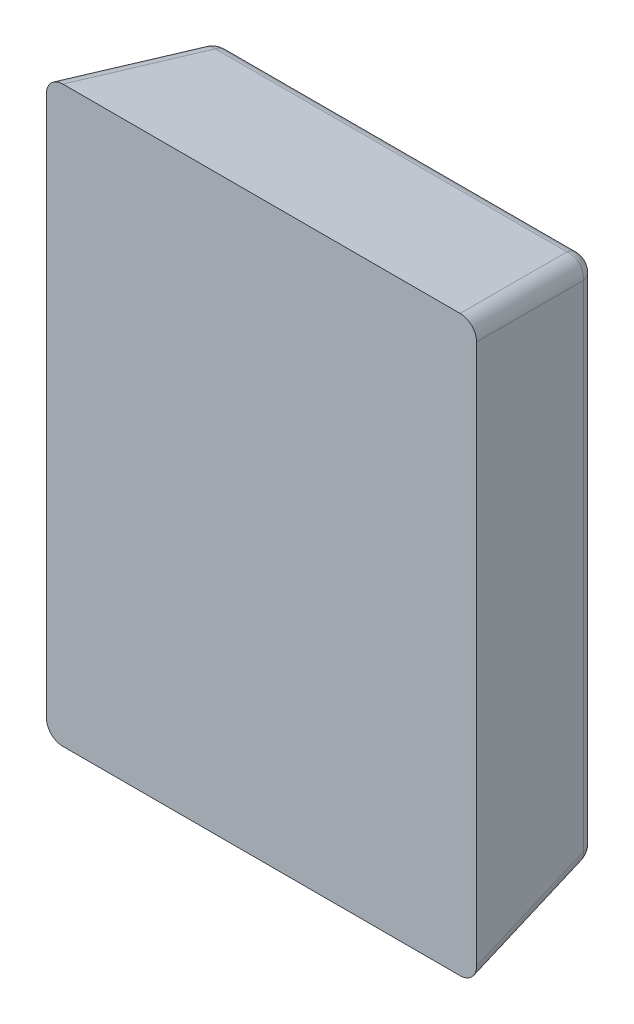
ISO-10303-21;
HEADER;
FILE_DESCRIPTION(('STEP AP214'),'2;1');
FILE_NAME('part.step','',(''),(''),'','','');
FILE_SCHEMA(('AUTOMOTIVE_DESIGN { 1 0 10303 214 1 1 1 1 }'));
ENDSEC;
DATA;
#1=APPLICATION_CONTEXT('core data for automotive mechanical design processes');
#2=APPLICATION_PROTOCOL_DEFINITION('international standard','automotive_design',2000,#1);
#3=PRODUCT_CONTEXT('',#1,'mechanical');
#4=PRODUCT('Part','Part','',(#3));
#5=PRODUCT_RELATED_PRODUCT_CATEGORY('part','',(#4));
#6=PRODUCT_DEFINITION_FORMATION('','',#4);
#7=PRODUCT_DEFINITION_CONTEXT('part definition',#1,'design');
#8=PRODUCT_DEFINITION('design','',#6,#7);
#9=PRODUCT_DEFINITION_SHAPE('','',#8);
#10=(LENGTH_UNIT() NAMED_UNIT(*) SI_UNIT(.MILLI.,.METRE.));
#11=(NAMED_UNIT(*) PLANE_ANGLE_UNIT() SI_UNIT($,.RADIAN.));
#12=(NAMED_UNIT(*) SI_UNIT($,.STERADIAN.) SOLID_ANGLE_UNIT());
#13=UNCERTAINTY_MEASURE_WITH_UNIT(LENGTH_MEASURE(1.E-05),#10,'distance_accuracy_value','');
#14=(GEOMETRIC_REPRESENTATION_CONTEXT(3) GLOBAL_UNCERTAINTY_ASSIGNED_CONTEXT((#13)) GLOBAL_UNIT_ASSIGNED_CONTEXT((#10,
#11,#12)) REPRESENTATION_CONTEXT('',''));
#15=CARTESIAN_POINT('',(0.,0.,0.));
#16=DIRECTION('',(0.,0.,1.));
#17=DIRECTION('',(1.,0.,0.));
#18=AXIS2_PLACEMENT_3D('',#15,#16,#17);
#19=CARTESIAN_POINT('',(-0.205464285309384,-0.641019643054923,0.105));
#20=DIRECTION('',(0.,0.,-1.));
#21=DIRECTION('',(-1.,0.,0.));
#22=AXIS2_PLACEMENT_3D('',#19,#20,#21);
#23=PLANE('',#22);
#24=DIRECTION('',(0.,-1.,0.));
#25=VECTOR('',#24,1.);
#26=CARTESIAN_POINT('',(-0.131917601570132,-0.701017157850477,0.105));
#27=LINE('',#26,#25);
#28=CARTESIAN_POINT('',(-0.131917601570131,-0.744561356385283,0.105));
#29=VERTEX_POINT('',#28);
#30=CARTESIAN_POINT('',(-0.131917601570132,-0.537477929724562,0.105));
#31=VERTEX_POINT('',#30);
#32=EDGE_CURVE('E134',#29,#31,#27,.F.);
#33=ORIENTED_EDGE('',*,*,#32,.F.);
#34=DIRECTION('',(-1.,0.,0.));
#35=VECTOR('',#34,1.);
#36=CARTESIAN_POINT('',(-0.250464285309384,-0.744561356385283,0.105));
#37=LINE('',#36,#35);
#38=CARTESIAN_POINT('',(-0.279010969048635,-0.744561356385283,0.105));
#39=VERTEX_POINT('',#38);
#40=EDGE_CURVE('E237',#39,#29,#37,.F.);
#41=ORIENTED_EDGE('',*,*,#40,.F.);
#42=DIRECTION('',(0.,1.,0.));
#43=VECTOR('',#42,1.);
#44=CARTESIAN_POINT('',(-0.279010969048635,-0.581022128259368,0.105));
#45=LINE('',#44,#43);
#46=CARTESIAN_POINT('',(-0.279010969048635,-0.537477929724562,0.105));
#47=VERTEX_POINT('',#46);
#48=EDGE_CURVE('E140',#47,#39,#45,.F.);
#49=ORIENTED_EDGE('',*,*,#48,.F.);
#50=DIRECTION('',(1.,0.,0.));
#51=VECTOR('',#50,1.);
#52=CARTESIAN_POINT('',(-0.160464285309383,-0.537477929724562,0.105));
#53=LINE('',#52,#51);
#54=EDGE_CURVE('E114',#31,#47,#53,.F.);
#55=ORIENTED_EDGE('',*,*,#54,.F.);
#56=EDGE_LOOP('',(#33,#41,#49,#55));
#57=FACE_BOUND('',#56,.T.);
#58=ADVANCED_FACE('F17',(#57),#23,.T.);
#59=CARTESIAN_POINT('',(-0.279010969048635,-0.581022128259368,0.112));
#60=DIRECTION('',(0.,1.,0.));
#61=DIRECTION('',(-1.,0.,0.));
#62=AXIS2_PLACEMENT_3D('',#59,#60,#61);
#63=CYLINDRICAL_SURFACE('',#62,0.007);
#64=DIRECTION('',(0.,1.,0.));
#65=VECTOR('',#64,1.);
#66=CARTESIAN_POINT('',(-0.285904623319721,-0.521024613463813,0.110784462756331));
#67=LINE('',#66,#65);
#68=CARTESIAN_POINT('',(-0.28590462331972,-0.537477929724562,0.110784462756331));
#69=VERTEX_POINT('',#68);
#70=CARTESIAN_POINT('',(-0.28590462331972,-0.744561356385283,0.110784462756331));
#71=VERTEX_POINT('',#70);
#72=EDGE_CURVE('E183',#69,#71,#67,.F.);
#73=ORIENTED_EDGE('',*,*,#72,.F.);
#74=CARTESIAN_POINT('',(-0.279010969048635,-0.537477929724562,0.112));
#75=DIRECTION('',(0.,1.,0.));
#76=DIRECTION('',(1.,0.,0.));
#77=AXIS2_PLACEMENT_3D('',#74,#75,#76);
#78=CIRCLE('',#77,0.007);
#79=EDGE_CURVE('E103',#47,#69,#78,.T.);
#80=ORIENTED_EDGE('',*,*,#79,.F.);
#81=ORIENTED_EDGE('',*,*,#48,.T.);
#82=CARTESIAN_POINT('',(-0.279010969048634,-0.744561356385283,0.112));
#83=DIRECTION('',(0.,1.,0.));
#84=DIRECTION('',(1.,0.,0.));
#85=AXIS2_PLACEMENT_3D('',#82,#83,#84);
#86=CIRCLE('',#85,0.007);
#87=EDGE_CURVE('E90',#71,#39,#86,.F.);
#88=ORIENTED_EDGE('',*,*,#87,.F.);
#89=EDGE_LOOP('',(#73,#80,#81,#88));
#90=FACE_BOUND('',#89,.T.);
#91=ADVANCED_FACE('F229',(#90),#63,.T.);
#92=CARTESIAN_POINT('',(-0.279010969048635,-0.537477929724562,0.112));
#93=DIRECTION('',(1.,0.,0.));
#94=DIRECTION('',(0.,1.,0.));
#95=AXIS2_PLACEMENT_3D('',#92,#93,#94);
#96=SPHERICAL_SURFACE('',#95,0.007);
#97=ORIENTED_EDGE('',*,*,#79,.T.);
#98=CARTESIAN_POINT('',(-0.279010969048634,-0.537477929724562,0.112));
#99=DIRECTION('',(-0.17108786974604,0.171087869746041,0.970287525247812));
#100=DIRECTION('',(0.,-0.984807753012207,0.173648177666936));
#101=AXIS2_PLACEMENT_3D('',#98,#99,#100);
#102=CIRCLE('',#101,0.007);
#103=CARTESIAN_POINT('',(-0.279010969048635,-0.530584275453477,0.110784462756331));
#104=VERTEX_POINT('',#103);
#105=EDGE_CURVE('E20',#104,#69,#102,.T.);
#106=ORIENTED_EDGE('',*,*,#105,.F.);
#107=CARTESIAN_POINT('',(-0.279010969048635,-0.537477929724562,0.112));
#108=DIRECTION('',(1.,0.,0.));
#109=DIRECTION('',(0.,1.,0.));
#110=AXIS2_PLACEMENT_3D('',#107,#108,#109);
#111=CIRCLE('',#110,0.007);
#112=EDGE_CURVE('E122',#47,#104,#111,.T.);
#113=ORIENTED_EDGE('',*,*,#112,.F.);
#114=EDGE_LOOP('',(#97,#106,#113));
#115=FACE_BOUND('',#114,.T.);
#116=ADVANCED_FACE('F226',(#115),#96,.T.);
#117=CARTESIAN_POINT('',(-0.160464285309383,-0.537477929724562,0.112));
#118=DIRECTION('',(1.,0.,0.));
#119=DIRECTION('',(0.,1.,0.));
#120=AXIS2_PLACEMENT_3D('',#117,#118,#119);
#121=CYLINDRICAL_SURFACE('',#120,0.007);
#122=DIRECTION('',(1.,0.,0.));
#123=VECTOR('',#122,1.);
#124=CARTESIAN_POINT('',(-0.115464285309383,-0.530584275453476,0.110784462756331));
#125=LINE('',#124,#123);
#126=CARTESIAN_POINT('',(-0.131917601570132,-0.530584275453476,0.110784462756331));
#127=VERTEX_POINT('',#126);
#128=EDGE_CURVE('E117',#127,#104,#125,.F.);
#129=ORIENTED_EDGE('',*,*,#128,.F.);
#130=CARTESIAN_POINT('',(-0.131917601570132,-0.537477929724562,0.112));
#131=DIRECTION('',(1.,0.,0.));
#132=DIRECTION('',(0.,1.,0.));
#133=AXIS2_PLACEMENT_3D('',#130,#131,#132);
#134=CIRCLE('',#133,0.00699999999999995);
#135=EDGE_CURVE('E110',#31,#127,#134,.T.);
#136=ORIENTED_EDGE('',*,*,#135,.F.);
#137=ORIENTED_EDGE('',*,*,#54,.T.);
#138=ORIENTED_EDGE('',*,*,#112,.T.);
#139=EDGE_LOOP('',(#129,#136,#137,#138));
#140=FACE_BOUND('',#139,.T.);
#141=ADVANCED_FACE('F112',(#140),#121,.T.);
#142=CARTESIAN_POINT('',(-0.131917601570132,-0.537477929724562,0.112));
#143=DIRECTION('',(1.,0.,0.));
#144=DIRECTION('',(0.,1.,0.));
#145=AXIS2_PLACEMENT_3D('',#142,#143,#144);
#146=SPHERICAL_SURFACE('',#145,0.007);
#147=ORIENTED_EDGE('',*,*,#135,.T.);
#148=CARTESIAN_POINT('',(-0.131917601570131,-0.537477929724561,0.111999999999999));
#149=DIRECTION('',(0.171087869746028,0.171087869746031,0.970287525247816));
#150=DIRECTION('',(0.,-0.984807753012209,0.173648177666926));
#151=AXIS2_PLACEMENT_3D('',#148,#149,#150);
#152=CIRCLE('',#151,0.007);
#153=CARTESIAN_POINT('',(-0.125023947299047,-0.537477929724562,0.110784462756331));
#154=VERTEX_POINT('',#153);
#155=EDGE_CURVE('E126',#154,#127,#152,.T.);
#156=ORIENTED_EDGE('',*,*,#155,.F.);
#157=CARTESIAN_POINT('',(-0.131917601570132,-0.537477929724562,0.112));
#158=DIRECTION('',(0.,-1.,0.));
#159=DIRECTION('',(1.,0.,0.));
#160=AXIS2_PLACEMENT_3D('',#157,#158,#159);
#161=CIRCLE('',#160,0.007);
#162=EDGE_CURVE('E121',#31,#154,#161,.T.);
#163=ORIENTED_EDGE('',*,*,#162,.F.);
#164=EDGE_LOOP('',(#147,#156,#163));
#165=FACE_BOUND('',#164,.T.);
#166=ADVANCED_FACE('F125',(#165),#146,.T.);
#167=CARTESIAN_POINT('',(-0.131917601570132,-0.701017157850477,0.112));
#168=DIRECTION('',(0.,-1.,0.));
#169=DIRECTION('',(1.,0.,0.));
#170=AXIS2_PLACEMENT_3D('',#167,#168,#169);
#171=CYLINDRICAL_SURFACE('',#170,0.007);
#172=DIRECTION('',(0.,1.,0.));
#173=VECTOR('',#172,1.);
#174=CARTESIAN_POINT('',(-0.125023947299046,-0.761014672646032,0.110784462756331));
#175=LINE('',#174,#173);
#176=CARTESIAN_POINT('',(-0.125023947299046,-0.744561356385283,0.110784462756331));
#177=VERTEX_POINT('',#176);
#178=EDGE_CURVE('E165',#177,#154,#175,.T.);
#179=ORIENTED_EDGE('',*,*,#178,.F.);
#180=CARTESIAN_POINT('',(-0.131917601570131,-0.744561356385283,0.112));
#181=DIRECTION('',(0.,1.,0.));
#182=DIRECTION('',(1.,0.,0.));
#183=AXIS2_PLACEMENT_3D('',#180,#181,#182);
#184=CIRCLE('',#183,0.007);
#185=EDGE_CURVE('E131',#29,#177,#184,.F.);
#186=ORIENTED_EDGE('',*,*,#185,.F.);
#187=ORIENTED_EDGE('',*,*,#32,.T.);
#188=ORIENTED_EDGE('',*,*,#162,.T.);
#189=EDGE_LOOP('',(#179,#186,#187,#188));
#190=FACE_BOUND('',#189,.T.);
#191=ADVANCED_FACE('F135',(#190),#171,.T.);
#192=CARTESIAN_POINT('',(-0.131917601570131,-0.744561356385283,0.112));
#193=DIRECTION('',(1.,0.,0.));
#194=DIRECTION('',(0.,1.,0.));
#195=AXIS2_PLACEMENT_3D('',#192,#193,#194);
#196=SPHERICAL_SURFACE('',#195,0.007);
#197=CARTESIAN_POINT('',(-0.131917601570131,-0.744561356385283,0.112));
#198=DIRECTION('',(-1.,0.,0.));
#199=DIRECTION('',(0.,-1.,0.));
#200=AXIS2_PLACEMENT_3D('',#197,#198,#199);
#201=CIRCLE('',#200,0.007);
#202=CARTESIAN_POINT('',(-0.131917601570131,-0.751455010656368,0.110784462756331));
#203=VERTEX_POINT('',#202);
#204=EDGE_CURVE('E216',#29,#203,#201,.T.);
#205=ORIENTED_EDGE('',*,*,#204,.F.);
#206=ORIENTED_EDGE('',*,*,#185,.T.);
#207=CARTESIAN_POINT('',(-0.131917601570131,-0.744561356385283,0.112));
#208=DIRECTION('',(0.171087869746032,-0.171087869746034,0.970287525247815));
#209=DIRECTION('',(0.,-0.984807753012208,-0.173648177666929));
#210=AXIS2_PLACEMENT_3D('',#207,#208,#209);
#211=CIRCLE('',#210,0.007);
#212=EDGE_CURVE('E162',#203,#177,#211,.T.);
#213=ORIENTED_EDGE('',*,*,#212,.F.);
#214=EDGE_LOOP('',(#205,#206,#213));
#215=FACE_BOUND('',#214,.T.);
#216=ADVANCED_FACE('F204',(#215),#196,.T.);
#217=CARTESIAN_POINT('',(-0.250464285309384,-0.744561356385283,0.112));
#218=DIRECTION('',(-1.,0.,0.));
#219=DIRECTION('',(0.,-1.,0.));
#220=AXIS2_PLACEMENT_3D('',#217,#218,#219);
#221=CYLINDRICAL_SURFACE('',#220,0.007);
#222=DIRECTION('',(1.,0.,0.));
#223=VECTOR('',#222,1.);
#224=CARTESIAN_POINT('',(-0.295464285309383,-0.751455010656368,0.110784462756331));
#225=LINE('',#224,#223);
#226=CARTESIAN_POINT('',(-0.279010969048634,-0.751455010656369,0.110784462756331));
#227=VERTEX_POINT('',#226);
#228=EDGE_CURVE('E163',#227,#203,#225,.T.);
#229=ORIENTED_EDGE('',*,*,#228,.F.);
#230=CARTESIAN_POINT('',(-0.279010969048634,-0.744561356385283,0.112));
#231=DIRECTION('',(1.,0.,0.));
#232=DIRECTION('',(0.,1.,0.));
#233=AXIS2_PLACEMENT_3D('',#230,#231,#232);
#234=CIRCLE('',#233,0.00699999999999995);
#235=EDGE_CURVE('E98',#39,#227,#234,.F.);
#236=ORIENTED_EDGE('',*,*,#235,.F.);
#237=ORIENTED_EDGE('',*,*,#40,.T.);
#238=ORIENTED_EDGE('',*,*,#204,.T.);
#239=EDGE_LOOP('',(#229,#236,#237,#238));
#240=FACE_BOUND('',#239,.T.);
#241=ADVANCED_FACE('F199',(#240),#221,.T.);
#242=CARTESIAN_POINT('',(-0.279010969048634,-0.744561356385283,0.112));
#243=DIRECTION('',(1.,0.,0.));
#244=DIRECTION('',(0.,1.,0.));
#245=AXIS2_PLACEMENT_3D('',#242,#243,#244);
#246=SPHERICAL_SURFACE('',#245,0.007);
#247=ORIENTED_EDGE('',*,*,#87,.T.);
#248=ORIENTED_EDGE('',*,*,#235,.T.);
#249=CARTESIAN_POINT('',(-0.279010969048634,-0.744561356385283,0.112));
#250=DIRECTION('',(-0.171087869746039,-0.171087869746042,0.970287525247812));
#251=DIRECTION('',(0.,-0.984807753012207,-0.173648177666937));
#252=AXIS2_PLACEMENT_3D('',#249,#250,#251);
#253=CIRCLE('',#252,0.007);
#254=EDGE_CURVE('E158',#71,#227,#253,.T.);
#255=ORIENTED_EDGE('',*,*,#254,.F.);
#256=EDGE_LOOP('',(#247,#248,#255));
#257=FACE_BOUND('',#256,.T.);
#258=ADVANCED_FACE('F194',(#257),#246,.T.);
#259=CARTESIAN_POINT('',(-0.295464285309384,-0.521024613463813,0.165));
#260=DIRECTION('',(-0.984807753012208,0.,-0.173648177666929));
#261=DIRECTION('',(-0.173648177666929,0.,0.984807753012208));
#262=AXIS2_PLACEMENT_3D('',#259,#260,#261);
#263=PLANE('',#262);
#264=DIRECTION('',(-0.17108786974604,0.171087869746041,0.970287525247812));
#265=VECTOR('',#264,1.);
#266=CARTESIAN_POINT('',(-0.293031674545797,-0.530350878498484,0.15120397880227));
#267=LINE('',#266,#265);
#268=CARTESIAN_POINT('',(-0.295464285309383,-0.527918267734898,0.165));
#269=VERTEX_POINT('',#268);
#270=EDGE_CURVE('E181',#69,#269,#267,.T.);
#271=ORIENTED_EDGE('',*,*,#270,.F.);
#272=ORIENTED_EDGE('',*,*,#72,.T.);
#273=DIRECTION('',(-0.171087869746032,-0.171087869746046,0.970287525247813));
#274=VECTOR('',#273,1.);
#275=CARTESIAN_POINT('',(-0.28590462331972,-0.744561356385283,0.110784462756331));
#276=LINE('',#275,#274);
#277=CARTESIAN_POINT('',(-0.295464285309383,-0.754121018374947,0.165));
#278=VERTEX_POINT('',#277);
#279=EDGE_CURVE('E186',#71,#278,#276,.T.);
#280=ORIENTED_EDGE('',*,*,#279,.T.);
#281=DIRECTION('',(0.,1.,0.));
#282=VECTOR('',#281,1.);
#283=CARTESIAN_POINT('',(-0.295464285309383,-0.641019643054923,0.165));
#284=LINE('',#283,#282);
#285=EDGE_CURVE('E155',#278,#269,#284,.T.);
#286=ORIENTED_EDGE('',*,*,#285,.T.);
#287=EDGE_LOOP('',(#271,#272,#280,#286));
#288=FACE_BOUND('',#287,.T.);
#289=ADVANCED_FACE('F198',(#288),#263,.T.);
#290=CARTESIAN_POINT('',(-0.286138020274712,-0.530350878498484,0.152419516045939));
#291=DIRECTION('',(-0.17108786974604,0.171087869746041,0.970287525247812));
#292=DIRECTION('',(0.,-0.984807753012207,0.173648177666936));
#293=AXIS2_PLACEMENT_3D('',#290,#291,#292);
#294=CYLINDRICAL_SURFACE('',#293,0.007);
#295=DIRECTION('',(-0.171087869746026,0.171087869746036,0.970287525247815));
#296=VECTOR('',#295,1.);
#297=CARTESIAN_POINT('',(-0.279010969048635,-0.530584275453477,0.110784462756331));
#298=LINE('',#297,#296);
#299=CARTESIAN_POINT('',(-0.288570631038298,-0.521024613463813,0.165));
#300=VERTEX_POINT('',#299);
#301=EDGE_CURVE('E172',#104,#300,#298,.T.);
#302=ORIENTED_EDGE('',*,*,#301,.F.);
#303=ORIENTED_EDGE('',*,*,#105,.T.);
#304=ORIENTED_EDGE('',*,*,#270,.T.);
#305=CARTESIAN_POINT('',(-0.288356299026183,-0.528132599747013,0.165));
#306=DIRECTION('',(0.,0.,-1.));
#307=DIRECTION('',(-0.707106781186545,0.707106781186551,0.));
#308=AXIS2_PLACEMENT_3D('',#305,#306,#307);
#309=ELLIPSE('',#308,0.00721435638184897,0.007);
#310=EDGE_CURVE('E153',#269,#300,#309,.T.);
#311=ORIENTED_EDGE('',*,*,#310,.T.);
#312=EDGE_LOOP('',(#302,#303,#304,#311));
#313=FACE_BOUND('',#312,.T.);
#314=ADVANCED_FACE('F273',(#313),#294,.T.);
#315=CARTESIAN_POINT('',(-0.115464285309383,-0.521024613463813,0.165));
#316=DIRECTION('',(0.,0.984807753012208,-0.17364817766693));
#317=DIRECTION('',(0.,0.17364817766693,0.984807753012208));
#318=AXIS2_PLACEMENT_3D('',#315,#316,#317);
#319=PLANE('',#318);
#320=DIRECTION('',(0.171087869746028,0.171087869746031,0.970287525247816));
#321=VECTOR('',#320,1.);
#322=CARTESIAN_POINT('',(-0.125668536630149,-0.524335210513493,0.146224671140071));
#323=LINE('',#322,#321);
#324=CARTESIAN_POINT('',(-0.122357939580469,-0.521024613463813,0.165));
#325=VERTEX_POINT('',#324);
#326=EDGE_CURVE('E166',#127,#325,#323,.T.);
#327=ORIENTED_EDGE('',*,*,#326,.F.);
#328=ORIENTED_EDGE('',*,*,#128,.T.);
#329=ORIENTED_EDGE('',*,*,#301,.T.);
#330=DIRECTION('',(-1.,0.,0.));
#331=VECTOR('',#330,1.);
#332=CARTESIAN_POINT('',(-0.205464285309384,-0.521024613463813,0.165));
#333=LINE('',#332,#331);
#334=EDGE_CURVE('E152',#300,#325,#333,.F.);
#335=ORIENTED_EDGE('',*,*,#334,.T.);
#336=EDGE_LOOP('',(#327,#328,#329,#335));
#337=FACE_BOUND('',#336,.T.);
#338=ADVANCED_FACE('F272',(#337),#319,.T.);
#339=CARTESIAN_POINT('',(-0.125668536630148,-0.531228864784578,0.147440208383739));
#340=DIRECTION('',(0.171087869746028,0.171087869746031,0.970287525247816));
#341=DIRECTION('',(0.,-0.984807753012209,0.173648177666926));
#342=AXIS2_PLACEMENT_3D('',#339,#340,#341);
#343=CYLINDRICAL_SURFACE('',#342,0.007);
#344=DIRECTION('',(0.171087869746033,0.171087869746044,0.970287525247813));
#345=VECTOR('',#344,1.);
#346=CARTESIAN_POINT('',(-0.125023947299047,-0.537477929724562,0.110784462756331));
#347=LINE('',#346,#345);
#348=CARTESIAN_POINT('',(-0.115464285309383,-0.527918267734898,0.165));
#349=VERTEX_POINT('',#348);
#350=EDGE_CURVE('E168',#154,#349,#347,.T.);
#351=ORIENTED_EDGE('',*,*,#350,.F.);
#352=ORIENTED_EDGE('',*,*,#155,.T.);
#353=ORIENTED_EDGE('',*,*,#326,.T.);
#354=CARTESIAN_POINT('',(-0.122572271592583,-0.528132599747013,0.165));
#355=DIRECTION('',(0.,0.,-1.));
#356=DIRECTION('',(0.707106781186542,0.707106781186553,0.));
#357=AXIS2_PLACEMENT_3D('',#354,#355,#356);
#358=ELLIPSE('',#357,0.00721435638184894,0.007);
#359=EDGE_CURVE('E150',#325,#349,#358,.T.);
#360=ORIENTED_EDGE('',*,*,#359,.T.);
#361=EDGE_LOOP('',(#351,#352,#353,#360));
#362=FACE_BOUND('',#361,.T.);
#363=ADVANCED_FACE('F293',(#362),#343,.T.);
#364=CARTESIAN_POINT('',(-0.115464285309383,-0.761014672646032,0.165));
#365=DIRECTION('',(0.984807753012208,0.,-0.173648177666928));
#366=DIRECTION('',(-0.173648177666928,0.,-0.984807753012208));
#367=AXIS2_PLACEMENT_3D('',#364,#365,#366);
#368=PLANE('',#367);
#369=ORIENTED_EDGE('',*,*,#350,.T.);
#370=DIRECTION('',(0.,1.,0.));
#371=VECTOR('',#370,1.);
#372=CARTESIAN_POINT('',(-0.115464285309383,-0.641019643054923,0.165));
#373=LINE('',#372,#371);
#374=CARTESIAN_POINT('',(-0.115464285309382,-0.754121018374946,0.165));
#375=VERTEX_POINT('',#374);
#376=EDGE_CURVE('E149',#349,#375,#373,.F.);
#377=ORIENTED_EDGE('',*,*,#376,.T.);
#378=DIRECTION('',(0.171087869746032,-0.171087869746034,0.970287525247815));
#379=VECTOR('',#378,1.);
#380=CARTESIAN_POINT('',(-0.117896896072968,-0.751688407611361,0.151203978802271));
#381=LINE('',#380,#379);
#382=EDGE_CURVE('E164',#177,#375,#381,.T.);
#383=ORIENTED_EDGE('',*,*,#382,.F.);
#384=ORIENTED_EDGE('',*,*,#178,.T.);
#385=EDGE_LOOP('',(#369,#377,#383,#384));
#386=FACE_BOUND('',#385,.T.);
#387=ADVANCED_FACE('F267',(#386),#368,.T.);
#388=CARTESIAN_POINT('',(-0.124790550344053,-0.751688407611361,0.152419516045939));
#389=DIRECTION('',(0.171087869746032,-0.171087869746034,0.970287525247815));
#390=DIRECTION('',(0.,-0.984807753012208,-0.173648177666929));
#391=AXIS2_PLACEMENT_3D('',#388,#389,#390);
#392=CYLINDRICAL_SURFACE('',#391,0.007);
#393=DIRECTION('',(0.171087869746027,-0.171087869746037,0.970287525247815));
#394=VECTOR('',#393,1.);
#395=CARTESIAN_POINT('',(-0.131917601570131,-0.751455010656368,0.110784462756331));
#396=LINE('',#395,#394);
#397=CARTESIAN_POINT('',(-0.122357939580468,-0.761014672646032,0.165));
#398=VERTEX_POINT('',#397);
#399=EDGE_CURVE('E161',#203,#398,#396,.T.);
#400=ORIENTED_EDGE('',*,*,#399,.F.);
#401=ORIENTED_EDGE('',*,*,#212,.T.);
#402=ORIENTED_EDGE('',*,*,#382,.T.);
#403=CARTESIAN_POINT('',(-0.122572271592582,-0.753906686362832,0.165));
#404=DIRECTION('',(0.,0.,-1.));
#405=DIRECTION('',(0.707106781186544,-0.707106781186551,0.));
#406=AXIS2_PLACEMENT_3D('',#403,#404,#405);
#407=ELLIPSE('',#406,0.00721435638184896,0.007);
#408=EDGE_CURVE('E26',#375,#398,#407,.T.);
#409=ORIENTED_EDGE('',*,*,#408,.T.);
#410=EDGE_LOOP('',(#400,#401,#402,#409));
#411=FACE_BOUND('',#410,.T.);
#412=ADVANCED_FACE('F257',(#411),#392,.T.);
#413=CARTESIAN_POINT('',(-0.295464285309383,-0.761014672646032,0.165));
#414=DIRECTION('',(0.,-0.984807753012208,-0.173648177666931));
#415=DIRECTION('',(0.,0.173648177666931,-0.984807753012208));
#416=AXIS2_PLACEMENT_3D('',#413,#414,#415);
#417=PLANE('',#416);
#418=ORIENTED_EDGE('',*,*,#399,.T.);
#419=DIRECTION('',(-1.,0.,0.));
#420=VECTOR('',#419,1.);
#421=CARTESIAN_POINT('',(-0.205464285309384,-0.761014672646032,0.165));
#422=LINE('',#421,#420);
#423=CARTESIAN_POINT('',(-0.288570631038298,-0.761014672646032,0.165));
#424=VERTEX_POINT('',#423);
#425=EDGE_CURVE('E11',#398,#424,#422,.T.);
#426=ORIENTED_EDGE('',*,*,#425,.T.);
#427=DIRECTION('',(-0.171087869746039,-0.171087869746042,0.970287525247812));
#428=VECTOR('',#427,1.);
#429=CARTESIAN_POINT('',(-0.285260033988618,-0.757704075596352,0.146224671140069));
#430=LINE('',#429,#428);
#431=EDGE_CURVE('E157',#227,#424,#430,.T.);
#432=ORIENTED_EDGE('',*,*,#431,.F.);
#433=ORIENTED_EDGE('',*,*,#228,.T.);
#434=EDGE_LOOP('',(#418,#426,#432,#433));
#435=FACE_BOUND('',#434,.T.);
#436=ADVANCED_FACE('F254',(#435),#417,.T.);
#437=CARTESIAN_POINT('',(-0.285260033988618,-0.750810421325267,0.147440208383738));
#438=DIRECTION('',(-0.171087869746039,-0.171087869746042,0.970287525247812));
#439=DIRECTION('',(0.,-0.984807753012207,-0.173648177666937));
#440=AXIS2_PLACEMENT_3D('',#437,#438,#439);
#441=CYLINDRICAL_SURFACE('',#440,0.007);
#442=ORIENTED_EDGE('',*,*,#431,.T.);
#443=CARTESIAN_POINT('',(-0.288356299026183,-0.753906686362832,0.165));
#444=DIRECTION('',(0.,0.,-1.));
#445=DIRECTION('',(-0.70710678118654,-0.707106781186555,0.));
#446=AXIS2_PLACEMENT_3D('',#443,#444,#445);
#447=ELLIPSE('',#446,0.00721435638184897,0.007);
#448=EDGE_CURVE('E35',#424,#278,#447,.T.);
#449=ORIENTED_EDGE('',*,*,#448,.T.);
#450=ORIENTED_EDGE('',*,*,#279,.F.);
#451=ORIENTED_EDGE('',*,*,#254,.T.);
#452=EDGE_LOOP('',(#442,#449,#450,#451));
#453=FACE_BOUND('',#452,.T.);
#454=ADVANCED_FACE('F278',(#453),#441,.T.);
#455=CARTESIAN_POINT('',(-0.205464285309384,-0.641019643054923,0.165));
#456=DIRECTION('',(0.,0.,-1.));
#457=DIRECTION('',(-1.,0.,0.));
#458=AXIS2_PLACEMENT_3D('',#455,#456,#457);
#459=PLANE('',#458);
#460=ORIENTED_EDGE('',*,*,#425,.F.);
#461=ORIENTED_EDGE('',*,*,#408,.F.);
#462=ORIENTED_EDGE('',*,*,#376,.F.);
#463=ORIENTED_EDGE('',*,*,#359,.F.);
#464=ORIENTED_EDGE('',*,*,#334,.F.);
#465=ORIENTED_EDGE('',*,*,#310,.F.);
#466=ORIENTED_EDGE('',*,*,#285,.F.);
#467=ORIENTED_EDGE('',*,*,#448,.F.);
#468=EDGE_LOOP('',(#460,#461,#462,#463,#464,#465,#466,#467));
#469=FACE_BOUND('',#468,.T.);
#470=ADVANCED_FACE('F268',(#469),#459,.F.);
#471=CLOSED_SHELL('',(#58,#91,#116,#141,#166,#191,#216,#241,#258,#289,#314,#338,#363,#387,#412,
#436,#454,#470));
#472=MANIFOLD_SOLID_BREP('B1',#471);
#473=ADVANCED_BREP_SHAPE_REPRESENTATION('',(#18,#472),#14);
#474=SHAPE_DEFINITION_REPRESENTATION(#9,#473);
ENDSEC;
END-ISO-10303-21;
